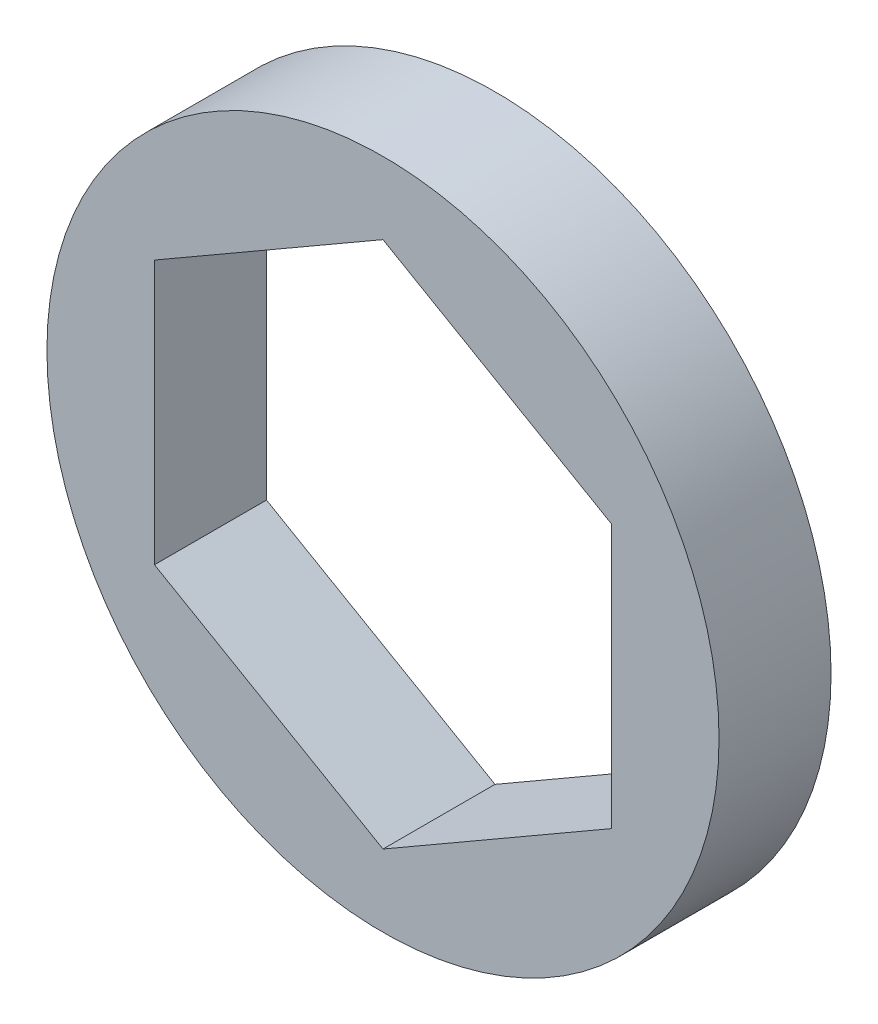
ISO-10303-21;
HEADER;
FILE_DESCRIPTION(('STEP AP214'),'2;1');
FILE_NAME('part.step','',(''),(''),'','','');
FILE_SCHEMA(('AUTOMOTIVE_DESIGN { 1 0 10303 214 1 1 1 1 }'));
ENDSEC;
DATA;
#1=APPLICATION_CONTEXT('core data for automotive mechanical design processes');
#2=APPLICATION_PROTOCOL_DEFINITION('international standard','automotive_design',2000,#1);
#3=PRODUCT_CONTEXT('',#1,'mechanical');
#4=PRODUCT('Part','Part','',(#3));
#5=PRODUCT_RELATED_PRODUCT_CATEGORY('part','',(#4));
#6=PRODUCT_DEFINITION_FORMATION('','',#4);
#7=PRODUCT_DEFINITION_CONTEXT('part definition',#1,'design');
#8=PRODUCT_DEFINITION('design','',#6,#7);
#9=PRODUCT_DEFINITION_SHAPE('','',#8);
#10=(LENGTH_UNIT() NAMED_UNIT(*) SI_UNIT(.MILLI.,.METRE.));
#11=(NAMED_UNIT(*) PLANE_ANGLE_UNIT() SI_UNIT($,.RADIAN.));
#12=(NAMED_UNIT(*) SI_UNIT($,.STERADIAN.) SOLID_ANGLE_UNIT());
#13=UNCERTAINTY_MEASURE_WITH_UNIT(LENGTH_MEASURE(1.E-05),#10,'distance_accuracy_value','');
#14=(GEOMETRIC_REPRESENTATION_CONTEXT(3) GLOBAL_UNCERTAINTY_ASSIGNED_CONTEXT((#13)) GLOBAL_UNIT_ASSIGNED_CONTEXT((#10,
#11,#12)) REPRESENTATION_CONTEXT('',''));
#15=CARTESIAN_POINT('',(0.,0.,0.));
#16=DIRECTION('',(0.,0.,1.));
#17=DIRECTION('',(1.,0.,0.));
#18=AXIS2_PLACEMENT_3D('',#15,#16,#17);
#19=CARTESIAN_POINT('',(0.,0.,-1.5875));
#20=DIRECTION('',(0.,0.,1.));
#21=DIRECTION('',(1.,0.,0.));
#22=AXIS2_PLACEMENT_3D('',#19,#20,#21);
#23=PLANE('',#22);
#24=DIRECTION('',(0.,1.,0.));
#25=VECTOR('',#24,1.);
#26=CARTESIAN_POINT('',(-6.477,3.73949769354121,-1.5875));
#27=LINE('',#26,#25);
#28=CARTESIAN_POINT('',(-6.47700000000001,-3.73949769354121,-1.5875));
#29=VERTEX_POINT('',#28);
#30=CARTESIAN_POINT('',(-6.47700000000001,3.73949769354121,-1.5875));
#31=VERTEX_POINT('',#30);
#32=EDGE_CURVE('E72',#29,#31,#27,.T.);
#33=ORIENTED_EDGE('',*,*,#32,.F.);
#34=DIRECTION('',(-0.866025403784439,0.5,0.));
#35=VECTOR('',#34,1.);
#36=CARTESIAN_POINT('',(-6.47700000000001,-3.73949769354121,-1.5875));
#37=LINE('',#36,#35);
#38=CARTESIAN_POINT('',(0.,-7.47899538708242,-1.5875));
#39=VERTEX_POINT('',#38);
#40=EDGE_CURVE('E102',#39,#29,#37,.T.);
#41=ORIENTED_EDGE('',*,*,#40,.F.);
#42=DIRECTION('',(-0.866025403784439,-0.5,0.));
#43=VECTOR('',#42,1.);
#44=CARTESIAN_POINT('',(0.,-7.47899538708242,-1.5875));
#45=LINE('',#44,#43);
#46=CARTESIAN_POINT('',(6.47700000000001,-3.73949769354122,-1.5875));
#47=VERTEX_POINT('',#46);
#48=EDGE_CURVE('E110',#47,#39,#45,.T.);
#49=ORIENTED_EDGE('',*,*,#48,.F.);
#50=DIRECTION('',(0.,-1.,0.));
#51=VECTOR('',#50,1.);
#52=CARTESIAN_POINT('',(6.47700000000001,-3.73949769354122,-1.5875));
#53=LINE('',#52,#51);
#54=CARTESIAN_POINT('',(6.47700000000001,3.73949769354121,-1.5875));
#55=VERTEX_POINT('',#54);
#56=EDGE_CURVE('E115',#55,#47,#53,.T.);
#57=ORIENTED_EDGE('',*,*,#56,.F.);
#58=DIRECTION('',(0.866025403784438,-0.5,0.));
#59=VECTOR('',#58,1.);
#60=CARTESIAN_POINT('',(6.47700000000001,3.73949769354121,-1.5875));
#61=LINE('',#60,#59);
#62=CARTESIAN_POINT('',(0.,7.47899538708242,-1.5875));
#63=VERTEX_POINT('',#62);
#64=EDGE_CURVE('E67',#63,#55,#61,.T.);
#65=ORIENTED_EDGE('',*,*,#64,.F.);
#66=DIRECTION('',(0.866025403784439,0.5,0.));
#67=VECTOR('',#66,1.);
#68=CARTESIAN_POINT('',(0.,7.47899538708242,-1.5875));
#69=LINE('',#68,#67);
#70=EDGE_CURVE('E69',#31,#63,#69,.T.);
#71=ORIENTED_EDGE('',*,*,#70,.F.);
#72=EDGE_LOOP('',(#33,#41,#49,#57,#65,#71));
#73=FACE_BOUND('',#72,.T.);
#74=CARTESIAN_POINT('',(0.,0.,-1.5875));
#75=DIRECTION('',(0.,0.,-1.));
#76=DIRECTION('',(-1.,0.,0.));
#77=AXIS2_PLACEMENT_3D('',#74,#75,#76);
#78=CIRCLE('',#77,9.525);
#79=CARTESIAN_POINT('',(-9.525,0.,-1.5875));
#80=VERTEX_POINT('',#79);
#81=EDGE_CURVE('E19',#80,#80,#78,.F.);
#82=ORIENTED_EDGE('',*,*,#81,.F.);
#83=EDGE_LOOP('',(#82));
#84=FACE_BOUND('',#83,.T.);
#85=ADVANCED_FACE('F16',(#73,#84),#23,.F.);
#86=CARTESIAN_POINT('',(0.,0.,1.5875));
#87=DIRECTION('',(0.,0.,-1.));
#88=DIRECTION('',(-1.,0.,0.));
#89=AXIS2_PLACEMENT_3D('',#86,#87,#88);
#90=CYLINDRICAL_SURFACE('',#89,9.525);
#91=ORIENTED_EDGE('',*,*,#81,.T.);
#92=EDGE_LOOP('',(#91));
#93=FACE_BOUND('',#92,.T.);
#94=CARTESIAN_POINT('',(0.,0.,1.5875));
#95=DIRECTION('',(0.,0.,-1.));
#96=DIRECTION('',(-1.,0.,0.));
#97=AXIS2_PLACEMENT_3D('',#94,#95,#96);
#98=CIRCLE('',#97,9.525);
#99=CARTESIAN_POINT('',(-9.525,0.,1.5875));
#100=VERTEX_POINT('',#99);
#101=EDGE_CURVE('E94',#100,#100,#98,.F.);
#102=ORIENTED_EDGE('',*,*,#101,.F.);
#103=EDGE_LOOP('',(#102));
#104=FACE_BOUND('',#103,.T.);
#105=ADVANCED_FACE('F152',(#93,#104),#90,.T.);
#106=CARTESIAN_POINT('',(-6.477,3.73949769354121,1.5875));
#107=DIRECTION('',(1.,0.,0.));
#108=DIRECTION('',(0.,1.,0.));
#109=AXIS2_PLACEMENT_3D('',#106,#107,#108);
#110=PLANE('',#109);
#111=DIRECTION('',(0.,1.,0.));
#112=VECTOR('',#111,1.);
#113=CARTESIAN_POINT('',(-6.47700000000001,0.,1.5875));
#114=LINE('',#113,#112);
#115=CARTESIAN_POINT('',(-6.47700000000001,-3.73949769354121,1.5875));
#116=VERTEX_POINT('',#115);
#117=CARTESIAN_POINT('',(-6.477,3.73949769354121,1.5875));
#118=VERTEX_POINT('',#117);
#119=EDGE_CURVE('E96',#116,#118,#114,.T.);
#120=ORIENTED_EDGE('',*,*,#119,.F.);
#121=DIRECTION('',(0.,0.,1.));
#122=VECTOR('',#121,1.);
#123=CARTESIAN_POINT('',(-6.47700000000001,-3.73949769354121,1.5875));
#124=LINE('',#123,#122);
#125=EDGE_CURVE('E83',#29,#116,#124,.T.);
#126=ORIENTED_EDGE('',*,*,#125,.F.);
#127=ORIENTED_EDGE('',*,*,#32,.T.);
#128=DIRECTION('',(0.,0.,1.));
#129=VECTOR('',#128,1.);
#130=CARTESIAN_POINT('',(-6.47700000000001,3.73949769354121,1.5875));
#131=LINE('',#130,#129);
#132=EDGE_CURVE('E77',#118,#31,#131,.F.);
#133=ORIENTED_EDGE('',*,*,#132,.F.);
#134=EDGE_LOOP('',(#120,#126,#127,#133));
#135=FACE_BOUND('',#134,.T.);
#136=ADVANCED_FACE('F80',(#135),#110,.T.);
#137=CARTESIAN_POINT('',(0.,7.47899538708242,1.5875));
#138=DIRECTION('',(0.5,-0.866025403784439,0.));
#139=DIRECTION('',(0.866025403784439,0.5,0.));
#140=AXIS2_PLACEMENT_3D('',#137,#138,#139);
#141=PLANE('',#140);
#142=DIRECTION('',(0.866025403784439,0.499999999999999,0.));
#143=VECTOR('',#142,1.);
#144=CARTESIAN_POINT('',(-6.477,3.73949769354121,1.5875));
#145=LINE('',#144,#143);
#146=CARTESIAN_POINT('',(0.,7.47899538708242,1.5875));
#147=VERTEX_POINT('',#146);
#148=EDGE_CURVE('E88',#118,#147,#145,.T.);
#149=ORIENTED_EDGE('',*,*,#148,.F.);
#150=ORIENTED_EDGE('',*,*,#132,.T.);
#151=ORIENTED_EDGE('',*,*,#70,.T.);
#152=DIRECTION('',(0.,0.,1.));
#153=VECTOR('',#152,1.);
#154=CARTESIAN_POINT('',(0.,7.47899538708242,1.5875));
#155=LINE('',#154,#153);
#156=EDGE_CURVE('E91',#147,#63,#155,.F.);
#157=ORIENTED_EDGE('',*,*,#156,.F.);
#158=EDGE_LOOP('',(#149,#150,#151,#157));
#159=FACE_BOUND('',#158,.T.);
#160=ADVANCED_FACE('F86',(#159),#141,.T.);
#161=CARTESIAN_POINT('',(6.47700000000001,3.73949769354121,1.5875));
#162=DIRECTION('',(-0.5,-0.866025403784438,0.));
#163=DIRECTION('',(0.866025403784438,-0.5,0.));
#164=AXIS2_PLACEMENT_3D('',#161,#162,#163);
#165=PLANE('',#164);
#166=DIRECTION('',(0.866025403784439,-0.5,0.));
#167=VECTOR('',#166,1.);
#168=CARTESIAN_POINT('',(0.,7.47899538708242,1.5875));
#169=LINE('',#168,#167);
#170=CARTESIAN_POINT('',(6.47700000000001,3.73949769354121,1.5875));
#171=VERTEX_POINT('',#170);
#172=EDGE_CURVE('E121',#147,#171,#169,.T.);
#173=ORIENTED_EDGE('',*,*,#172,.F.);
#174=ORIENTED_EDGE('',*,*,#156,.T.);
#175=ORIENTED_EDGE('',*,*,#64,.T.);
#176=DIRECTION('',(0.,0.,1.));
#177=VECTOR('',#176,1.);
#178=CARTESIAN_POINT('',(6.47700000000001,3.73949769354121,1.5875));
#179=LINE('',#178,#177);
#180=EDGE_CURVE('E112',#171,#55,#179,.F.);
#181=ORIENTED_EDGE('',*,*,#180,.F.);
#182=EDGE_LOOP('',(#173,#174,#175,#181));
#183=FACE_BOUND('',#182,.T.);
#184=ADVANCED_FACE('F119',(#183),#165,.T.);
#185=CARTESIAN_POINT('',(6.47700000000001,-3.73949769354122,1.5875));
#186=DIRECTION('',(-1.,0.,0.));
#187=DIRECTION('',(0.,-1.,0.));
#188=AXIS2_PLACEMENT_3D('',#185,#186,#187);
#189=PLANE('',#188);
#190=DIRECTION('',(0.,1.,0.));
#191=VECTOR('',#190,1.);
#192=CARTESIAN_POINT('',(6.47700000000001,0.,1.5875));
#193=LINE('',#192,#191);
#194=CARTESIAN_POINT('',(6.47700000000001,-3.73949769354122,1.5875));
#195=VERTEX_POINT('',#194);
#196=EDGE_CURVE('E125',#171,#195,#193,.F.);
#197=ORIENTED_EDGE('',*,*,#196,.F.);
#198=ORIENTED_EDGE('',*,*,#180,.T.);
#199=ORIENTED_EDGE('',*,*,#56,.T.);
#200=DIRECTION('',(0.,0.,1.));
#201=VECTOR('',#200,1.);
#202=CARTESIAN_POINT('',(6.47700000000001,-3.73949769354122,1.5875));
#203=LINE('',#202,#201);
#204=EDGE_CURVE('E107',#195,#47,#203,.F.);
#205=ORIENTED_EDGE('',*,*,#204,.F.);
#206=EDGE_LOOP('',(#197,#198,#199,#205));
#207=FACE_BOUND('',#206,.T.);
#208=ADVANCED_FACE('F133',(#207),#189,.T.);
#209=CARTESIAN_POINT('',(0.,-7.47899538708242,1.5875));
#210=DIRECTION('',(-0.5,0.866025403784439,0.));
#211=DIRECTION('',(-0.866025403784439,-0.5,0.));
#212=AXIS2_PLACEMENT_3D('',#209,#210,#211);
#213=PLANE('',#212);
#214=DIRECTION('',(-0.866025403784439,-0.5,0.));
#215=VECTOR('',#214,1.);
#216=CARTESIAN_POINT('',(6.47700000000001,-3.73949769354122,1.5875));
#217=LINE('',#216,#215);
#218=CARTESIAN_POINT('',(0.,-7.47899538708242,1.5875));
#219=VERTEX_POINT('',#218);
#220=EDGE_CURVE('E25',#195,#219,#217,.T.);
#221=ORIENTED_EDGE('',*,*,#220,.F.);
#222=ORIENTED_EDGE('',*,*,#204,.T.);
#223=ORIENTED_EDGE('',*,*,#48,.T.);
#224=DIRECTION('',(0.,0.,1.));
#225=VECTOR('',#224,1.);
#226=CARTESIAN_POINT('',(0.,-7.47899538708242,1.5875));
#227=LINE('',#226,#225);
#228=EDGE_CURVE('E34',#219,#39,#227,.F.);
#229=ORIENTED_EDGE('',*,*,#228,.F.);
#230=EDGE_LOOP('',(#221,#222,#223,#229));
#231=FACE_BOUND('',#230,.T.);
#232=ADVANCED_FACE('F131',(#231),#213,.T.);
#233=CARTESIAN_POINT('',(-6.47700000000001,-3.73949769354121,1.5875));
#234=DIRECTION('',(0.5,0.866025403784439,0.));
#235=DIRECTION('',(-0.866025403784439,0.5,0.));
#236=AXIS2_PLACEMENT_3D('',#233,#234,#235);
#237=PLANE('',#236);
#238=DIRECTION('',(-0.866025403784439,0.5,0.));
#239=VECTOR('',#238,1.);
#240=CARTESIAN_POINT('',(0.,-7.47899538708242,1.5875));
#241=LINE('',#240,#239);
#242=EDGE_CURVE('E11',#219,#116,#241,.T.);
#243=ORIENTED_EDGE('',*,*,#242,.F.);
#244=ORIENTED_EDGE('',*,*,#228,.T.);
#245=ORIENTED_EDGE('',*,*,#40,.T.);
#246=ORIENTED_EDGE('',*,*,#125,.T.);
#247=EDGE_LOOP('',(#243,#244,#245,#246));
#248=FACE_BOUND('',#247,.T.);
#249=ADVANCED_FACE('F134',(#248),#237,.T.);
#250=CARTESIAN_POINT('',(0.,0.,1.5875));
#251=DIRECTION('',(0.,0.,1.));
#252=DIRECTION('',(1.,0.,0.));
#253=AXIS2_PLACEMENT_3D('',#250,#251,#252);
#254=PLANE('',#253);
#255=ORIENTED_EDGE('',*,*,#220,.T.);
#256=ORIENTED_EDGE('',*,*,#242,.T.);
#257=ORIENTED_EDGE('',*,*,#119,.T.);
#258=ORIENTED_EDGE('',*,*,#148,.T.);
#259=ORIENTED_EDGE('',*,*,#172,.T.);
#260=ORIENTED_EDGE('',*,*,#196,.T.);
#261=EDGE_LOOP('',(#255,#256,#257,#258,#259,#260));
#262=FACE_BOUND('',#261,.T.);
#263=ORIENTED_EDGE('',*,*,#101,.T.);
#264=EDGE_LOOP('',(#263));
#265=FACE_BOUND('',#264,.T.);
#266=ADVANCED_FACE('F128',(#262,#265),#254,.T.);
#267=CLOSED_SHELL('',(#85,#105,#136,#160,#184,#208,#232,#249,#266));
#268=MANIFOLD_SOLID_BREP('B1',#267);
#269=ADVANCED_BREP_SHAPE_REPRESENTATION('',(#18,#268),#14);
#270=SHAPE_DEFINITION_REPRESENTATION(#9,#269);
ENDSEC;
END-ISO-10303-21;
